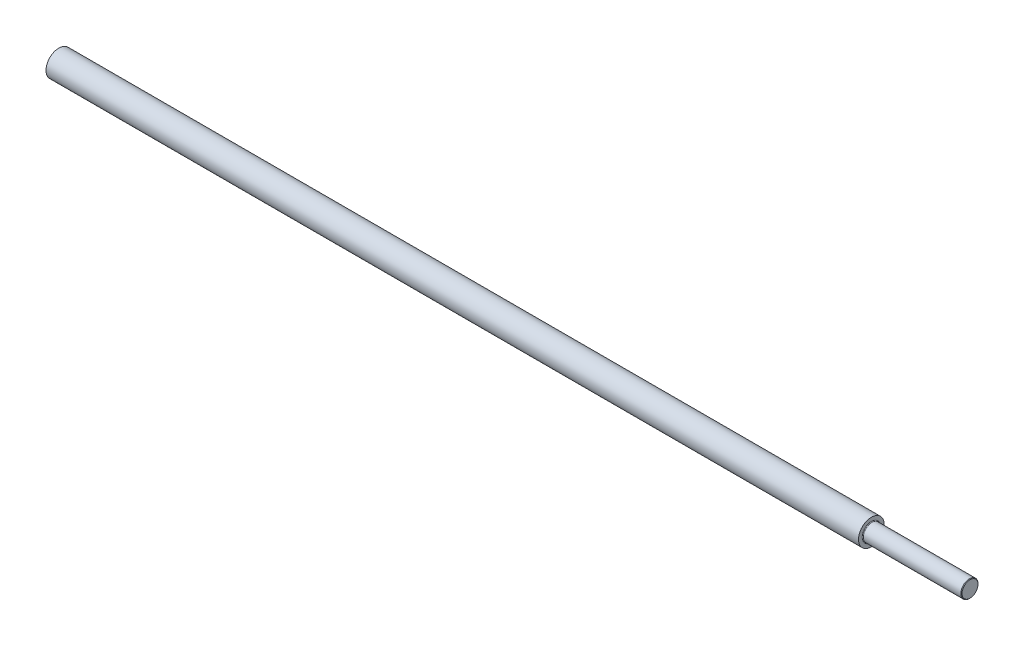
ISO-10303-21;
HEADER;
FILE_DESCRIPTION(('STEP AP214'),'2;1');
FILE_NAME('part.step','',(''),(''),'','','');
FILE_SCHEMA(('AUTOMOTIVE_DESIGN { 1 0 10303 214 1 1 1 1 }'));
ENDSEC;
DATA;
#1=APPLICATION_CONTEXT('core data for automotive mechanical design processes');
#2=APPLICATION_PROTOCOL_DEFINITION('international standard','automotive_design',2000,#1);
#3=PRODUCT_CONTEXT('',#1,'mechanical');
#4=PRODUCT('Part','Part','',(#3));
#5=PRODUCT_RELATED_PRODUCT_CATEGORY('part','',(#4));
#6=PRODUCT_DEFINITION_FORMATION('','',#4);
#7=PRODUCT_DEFINITION_CONTEXT('part definition',#1,'design');
#8=PRODUCT_DEFINITION('design','',#6,#7);
#9=PRODUCT_DEFINITION_SHAPE('','',#8);
#10=(LENGTH_UNIT() NAMED_UNIT(*) SI_UNIT(.MILLI.,.METRE.));
#11=(NAMED_UNIT(*) PLANE_ANGLE_UNIT() SI_UNIT($,.RADIAN.));
#12=(NAMED_UNIT(*) SI_UNIT($,.STERADIAN.) SOLID_ANGLE_UNIT());
#13=UNCERTAINTY_MEASURE_WITH_UNIT(LENGTH_MEASURE(1.E-05),#10,'distance_accuracy_value','');
#14=(GEOMETRIC_REPRESENTATION_CONTEXT(3) GLOBAL_UNCERTAINTY_ASSIGNED_CONTEXT((#13)) GLOBAL_UNIT_ASSIGNED_CONTEXT((#10,
#11,#12)) REPRESENTATION_CONTEXT('',''));
#15=CARTESIAN_POINT('',(0.,0.,0.));
#16=DIRECTION('',(0.,0.,1.));
#17=DIRECTION('',(1.,0.,0.));
#18=AXIS2_PLACEMENT_3D('',#15,#16,#17);
#19=CARTESIAN_POINT('',(425.,3.73333333333329,0.));
#20=DIRECTION('',(-1.,0.,0.));
#21=DIRECTION('',(0.,-1.,0.));
#22=AXIS2_PLACEMENT_3D('',#19,#20,#21);
#23=PLANE('',#22);
#24=CARTESIAN_POINT('',(425.,0.,0.));
#25=DIRECTION('',(-1.,0.,0.));
#26=DIRECTION('',(0.,-1.,0.));
#27=AXIS2_PLACEMENT_3D('',#24,#25,#26);
#28=CIRCLE('',#27,3.73333333333326);
#29=CARTESIAN_POINT('',(425.,-3.73333333333322,0.));
#30=VERTEX_POINT('',#29);
#31=EDGE_CURVE('E10',#30,#30,#28,.T.);
#32=ORIENTED_EDGE('',*,*,#31,.F.);
#33=EDGE_LOOP('',(#32));
#34=FACE_BOUND('',#33,.T.);
#35=ADVANCED_FACE('F35',(#34),#23,.F.);
#36=CARTESIAN_POINT('',(425.,0.,0.));
#37=DIRECTION('',(-1.,0.,0.));
#38=DIRECTION('',(0.,-1.,0.));
#39=AXIS2_PLACEMENT_3D('',#36,#37,#38);
#40=CONICAL_SURFACE('',#39,3.73333333333326,0.785398163391325);
#41=CARTESIAN_POINT('',(424.73333333333,0.,0.));
#42=DIRECTION('',(-1.,0.,0.));
#43=DIRECTION('',(0.,-1.,0.));
#44=AXIS2_PLACEMENT_3D('',#41,#42,#43);
#45=CIRCLE('',#44,3.99999999999996);
#46=CARTESIAN_POINT('',(424.73333333333,-3.99999999999992,0.));
#47=VERTEX_POINT('',#46);
#48=EDGE_CURVE('E41',#47,#47,#45,.T.);
#49=ORIENTED_EDGE('',*,*,#48,.F.);
#50=EDGE_LOOP('',(#49));
#51=FACE_BOUND('',#50,.T.);
#52=ORIENTED_EDGE('',*,*,#31,.T.);
#53=EDGE_LOOP('',(#52));
#54=FACE_BOUND('',#53,.T.);
#55=ADVANCED_FACE('F83',(#51,#54),#40,.T.);
#56=CARTESIAN_POINT('',(425.,0.,0.));
#57=DIRECTION('',(-1.,0.,0.));
#58=DIRECTION('',(0.,-1.,0.));
#59=AXIS2_PLACEMENT_3D('',#56,#57,#58);
#60=CYLINDRICAL_SURFACE('',#59,3.99999999999994);
#61=CARTESIAN_POINT('',(379.299999999993,0.,0.));
#62=DIRECTION('',(-1.,0.,0.));
#63=DIRECTION('',(0.,-1.,0.));
#64=AXIS2_PLACEMENT_3D('',#61,#62,#63);
#65=CIRCLE('',#64,3.99999999999992);
#66=CARTESIAN_POINT('',(379.299999999993,-3.99999999999989,0.));
#67=VERTEX_POINT('',#66);
#68=EDGE_CURVE('E45',#67,#67,#65,.T.);
#69=ORIENTED_EDGE('',*,*,#68,.F.);
#70=EDGE_LOOP('',(#69));
#71=FACE_BOUND('',#70,.T.);
#72=ORIENTED_EDGE('',*,*,#48,.T.);
#73=EDGE_LOOP('',(#72));
#74=FACE_BOUND('',#73,.T.);
#75=ADVANCED_FACE('F78',(#71,#74),#60,.T.);
#76=CARTESIAN_POINT('',(379.299999999993,0.,0.));
#77=DIRECTION('',(-1.,0.,0.));
#78=DIRECTION('',(0.,-1.,0.));
#79=AXIS2_PLACEMENT_3D('',#76,#77,#78);
#80=TOROIDAL_SURFACE('',#79,4.29999999999308,0.299999999993156);
#81=CARTESIAN_POINT('',(379.,0.,0.));
#82=DIRECTION('',(-1.,0.,0.));
#83=DIRECTION('',(0.,-1.,0.));
#84=AXIS2_PLACEMENT_3D('',#81,#82,#83);
#85=CIRCLE('',#84,4.29999999999308);
#86=CARTESIAN_POINT('',(379.,-4.29999999999305,0.));
#87=VERTEX_POINT('',#86);
#88=EDGE_CURVE('E49',#87,#87,#85,.T.);
#89=ORIENTED_EDGE('',*,*,#88,.F.);
#90=EDGE_LOOP('',(#89));
#91=FACE_BOUND('',#90,.T.);
#92=ORIENTED_EDGE('',*,*,#68,.T.);
#93=EDGE_LOOP('',(#92));
#94=FACE_BOUND('',#93,.T.);
#95=ADVANCED_FACE('F72',(#91,#94),#80,.F.);
#96=CARTESIAN_POINT('',(379.,6.,0.));
#97=DIRECTION('',(-1.,0.,0.));
#98=DIRECTION('',(0.,-1.,0.));
#99=AXIS2_PLACEMENT_3D('',#96,#97,#98);
#100=PLANE('',#99);
#101=CARTESIAN_POINT('',(379.,0.,0.));
#102=DIRECTION('',(-1.,0.,0.));
#103=DIRECTION('',(0.,-1.,0.));
#104=AXIS2_PLACEMENT_3D('',#101,#102,#103);
#105=CIRCLE('',#104,5.99999999999997);
#106=CARTESIAN_POINT('',(379.,-5.99999999999994,0.));
#107=VERTEX_POINT('',#106);
#108=EDGE_CURVE('E54',#107,#107,#105,.T.);
#109=ORIENTED_EDGE('',*,*,#108,.F.);
#110=EDGE_LOOP('',(#109));
#111=FACE_BOUND('',#110,.T.);
#112=ORIENTED_EDGE('',*,*,#88,.T.);
#113=EDGE_LOOP('',(#112));
#114=FACE_BOUND('',#113,.T.);
#115=ADVANCED_FACE('F66',(#111,#114),#100,.F.);
#116=CARTESIAN_POINT('',(425.,0.,0.));
#117=DIRECTION('',(-1.,0.,0.));
#118=DIRECTION('',(0.,-1.,0.));
#119=AXIS2_PLACEMENT_3D('',#116,#117,#118);
#120=CYLINDRICAL_SURFACE('',#119,5.99999999999998);
#121=CARTESIAN_POINT('',(0.,0.,0.));
#122=DIRECTION('',(-1.,0.,0.));
#123=DIRECTION('',(0.,-1.,0.));
#124=AXIS2_PLACEMENT_3D('',#121,#122,#123);
#125=CIRCLE('',#124,6.);
#126=CARTESIAN_POINT('',(0.,-6.,0.));
#127=VERTEX_POINT('',#126);
#128=EDGE_CURVE('E57',#127,#127,#125,.T.);
#129=ORIENTED_EDGE('',*,*,#128,.F.);
#130=EDGE_LOOP('',(#129));
#131=FACE_BOUND('',#130,.T.);
#132=ORIENTED_EDGE('',*,*,#108,.T.);
#133=EDGE_LOOP('',(#132));
#134=FACE_BOUND('',#133,.T.);
#135=ADVANCED_FACE('F63',(#131,#134),#120,.T.);
#136=CARTESIAN_POINT('',(0.,0.,0.));
#137=DIRECTION('',(1.,0.,0.));
#138=DIRECTION('',(0.,1.,0.));
#139=AXIS2_PLACEMENT_3D('',#136,#137,#138);
#140=PLANE('',#139);
#141=ORIENTED_EDGE('',*,*,#128,.T.);
#142=EDGE_LOOP('',(#141));
#143=FACE_BOUND('',#142,.T.);
#144=ADVANCED_FACE('F61',(#143),#140,.F.);
#145=CLOSED_SHELL('',(#35,#55,#75,#95,#115,#135,#144));
#146=MANIFOLD_SOLID_BREP('B2',#145);
#147=ADVANCED_BREP_SHAPE_REPRESENTATION('',(#18,#146),#14);
#148=SHAPE_DEFINITION_REPRESENTATION(#9,#147);
ENDSEC;
END-ISO-10303-21;
